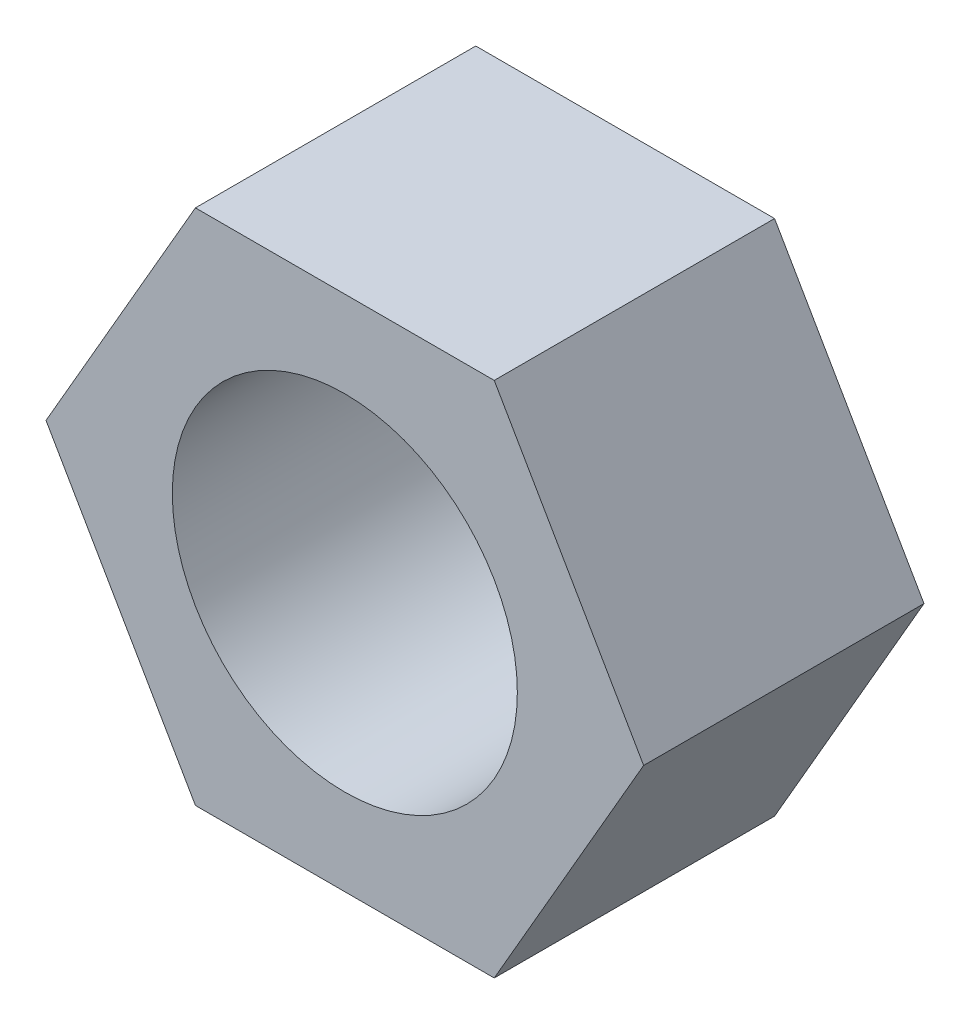
ISO-10303-21;
HEADER;
FILE_DESCRIPTION(('STEP AP214'),'2;1');
FILE_NAME('part.step','',(''),(''),'','','');
FILE_SCHEMA(('AUTOMOTIVE_DESIGN { 1 0 10303 214 1 1 1 1 }'));
ENDSEC;
DATA;
#1=APPLICATION_CONTEXT('core data for automotive mechanical design processes');
#2=APPLICATION_PROTOCOL_DEFINITION('international standard','automotive_design',2000,#1);
#3=PRODUCT_CONTEXT('',#1,'mechanical');
#4=PRODUCT('Part','Part','',(#3));
#5=PRODUCT_RELATED_PRODUCT_CATEGORY('part','',(#4));
#6=PRODUCT_DEFINITION_FORMATION('','',#4);
#7=PRODUCT_DEFINITION_CONTEXT('part definition',#1,'design');
#8=PRODUCT_DEFINITION('design','',#6,#7);
#9=PRODUCT_DEFINITION_SHAPE('','',#8);
#10=(LENGTH_UNIT() NAMED_UNIT(*) SI_UNIT(.MILLI.,.METRE.));
#11=(NAMED_UNIT(*) PLANE_ANGLE_UNIT() SI_UNIT($,.RADIAN.));
#12=(NAMED_UNIT(*) SI_UNIT($,.STERADIAN.) SOLID_ANGLE_UNIT());
#13=UNCERTAINTY_MEASURE_WITH_UNIT(LENGTH_MEASURE(1.E-05),#10,'distance_accuracy_value','');
#14=(GEOMETRIC_REPRESENTATION_CONTEXT(3) GLOBAL_UNCERTAINTY_ASSIGNED_CONTEXT((#13)) GLOBAL_UNIT_ASSIGNED_CONTEXT((#10,
#11,#12)) REPRESENTATION_CONTEXT('',''));
#15=CARTESIAN_POINT('',(0.,0.,0.));
#16=DIRECTION('',(0.,0.,1.));
#17=DIRECTION('',(1.,0.,0.));
#18=AXIS2_PLACEMENT_3D('',#15,#16,#17);
#19=CARTESIAN_POINT('',(0.,0.,6.5));
#20=DIRECTION('',(0.,0.,1.));
#21=DIRECTION('',(1.,0.,0.));
#22=AXIS2_PLACEMENT_3D('',#19,#20,#21);
#23=PLANE('',#22);
#24=DIRECTION('',(0.499999999999995,0.866025403784441,0.));
#25=VECTOR('',#24,1.);
#26=CARTESIAN_POINT('',(3.46410161513781,-5.99999999999994,6.5));
#27=LINE('',#26,#25);
#28=CARTESIAN_POINT('',(3.46410161513781,-5.99999999999994,6.5));
#29=VERTEX_POINT('',#28);
#30=CARTESIAN_POINT('',(6.92820323027549,0.,6.5));
#31=VERTEX_POINT('',#30);
#32=EDGE_CURVE('E129',#29,#31,#27,.T.);
#33=ORIENTED_EDGE('',*,*,#32,.T.);
#34=DIRECTION('',(-0.500000000000001,0.866025403784438,0.));
#35=VECTOR('',#34,1.);
#36=CARTESIAN_POINT('',(6.92820323027549,0.,6.5));
#37=LINE('',#36,#35);
#38=CARTESIAN_POINT('',(3.46410161513773,5.99999999999999,6.5));
#39=VERTEX_POINT('',#38);
#40=EDGE_CURVE('E87',#31,#39,#37,.T.);
#41=ORIENTED_EDGE('',*,*,#40,.T.);
#42=DIRECTION('',(-1.,0.,0.));
#43=VECTOR('',#42,1.);
#44=CARTESIAN_POINT('',(3.46410161513773,5.99999999999999,6.5));
#45=LINE('',#44,#43);
#46=CARTESIAN_POINT('',(-3.46410161513777,5.99999999999996,6.5));
#47=VERTEX_POINT('',#46);
#48=EDGE_CURVE('E100',#39,#47,#45,.T.);
#49=ORIENTED_EDGE('',*,*,#48,.T.);
#50=DIRECTION('',(-0.499999999999995,-0.866025403784442,0.));
#51=VECTOR('',#50,1.);
#52=CARTESIAN_POINT('',(-3.46410161513777,5.99999999999996,6.5));
#53=LINE('',#52,#51);
#54=CARTESIAN_POINT('',(-6.92820323027549,0.,6.5));
#55=VERTEX_POINT('',#54);
#56=EDGE_CURVE('E94',#47,#55,#53,.T.);
#57=ORIENTED_EDGE('',*,*,#56,.T.);
#58=DIRECTION('',(0.500000000000007,-0.866025403784434,0.));
#59=VECTOR('',#58,1.);
#60=CARTESIAN_POINT('',(-6.92820323027549,0.,6.5));
#61=LINE('',#60,#59);
#62=CARTESIAN_POINT('',(-3.46410161513769,-6.00000000000001,6.5));
#63=VERTEX_POINT('',#62);
#64=EDGE_CURVE('E98',#55,#63,#61,.T.);
#65=ORIENTED_EDGE('',*,*,#64,.T.);
#66=DIRECTION('',(1.,0.,0.));
#67=VECTOR('',#66,1.);
#68=CARTESIAN_POINT('',(-3.46410161513769,-6.00000000000001,6.5));
#69=LINE('',#68,#67);
#70=EDGE_CURVE('E50',#63,#29,#69,.T.);
#71=ORIENTED_EDGE('',*,*,#70,.T.);
#72=EDGE_LOOP('',(#33,#41,#49,#57,#65,#71));
#73=FACE_BOUND('',#72,.T.);
#74=CARTESIAN_POINT('',(0.,0.,6.5));
#75=DIRECTION('',(0.,0.,1.));
#76=DIRECTION('',(1.,0.,0.));
#77=AXIS2_PLACEMENT_3D('',#74,#75,#76);
#78=CIRCLE('',#77,4.);
#79=CARTESIAN_POINT('',(4.,0.,6.5));
#80=VERTEX_POINT('',#79);
#81=EDGE_CURVE('E122',#80,#80,#78,.T.);
#82=ORIENTED_EDGE('',*,*,#81,.F.);
#83=EDGE_LOOP('',(#82));
#84=FACE_BOUND('',#83,.T.);
#85=ADVANCED_FACE('F33',(#73,#84),#23,.T.);
#86=CARTESIAN_POINT('',(0.,0.,0.));
#87=DIRECTION('',(0.,0.,1.));
#88=DIRECTION('',(1.,0.,0.));
#89=AXIS2_PLACEMENT_3D('',#86,#87,#88);
#90=PLANE('',#89);
#91=DIRECTION('',(0.499999999999995,0.866025403784441,0.));
#92=VECTOR('',#91,1.);
#93=CARTESIAN_POINT('',(3.46410161513781,-5.99999999999994,0.));
#94=LINE('',#93,#92);
#95=CARTESIAN_POINT('',(3.46410161513781,-5.99999999999994,0.));
#96=VERTEX_POINT('',#95);
#97=CARTESIAN_POINT('',(6.92820323027549,0.,0.));
#98=VERTEX_POINT('',#97);
#99=EDGE_CURVE('E118',#96,#98,#94,.T.);
#100=ORIENTED_EDGE('',*,*,#99,.F.);
#101=DIRECTION('',(1.,0.,0.));
#102=VECTOR('',#101,1.);
#103=CARTESIAN_POINT('',(-3.46410161513769,-6.00000000000001,0.));
#104=LINE('',#103,#102);
#105=CARTESIAN_POINT('',(-3.46410161513769,-6.00000000000001,0.));
#106=VERTEX_POINT('',#105);
#107=EDGE_CURVE('E79',#106,#96,#104,.T.);
#108=ORIENTED_EDGE('',*,*,#107,.F.);
#109=DIRECTION('',(0.500000000000007,-0.866025403784434,0.));
#110=VECTOR('',#109,1.);
#111=CARTESIAN_POINT('',(-6.92820323027549,0.,0.));
#112=LINE('',#111,#110);
#113=CARTESIAN_POINT('',(-6.92820323027549,0.,0.));
#114=VERTEX_POINT('',#113);
#115=EDGE_CURVE('E73',#114,#106,#112,.T.);
#116=ORIENTED_EDGE('',*,*,#115,.F.);
#117=DIRECTION('',(-0.499999999999995,-0.866025403784442,0.));
#118=VECTOR('',#117,1.);
#119=CARTESIAN_POINT('',(-3.46410161513777,5.99999999999996,0.));
#120=LINE('',#119,#118);
#121=CARTESIAN_POINT('',(-3.46410161513777,5.99999999999996,0.));
#122=VERTEX_POINT('',#121);
#123=EDGE_CURVE('E108',#122,#114,#120,.T.);
#124=ORIENTED_EDGE('',*,*,#123,.F.);
#125=DIRECTION('',(-1.,0.,0.));
#126=VECTOR('',#125,1.);
#127=CARTESIAN_POINT('',(3.46410161513773,5.99999999999999,0.));
#128=LINE('',#127,#126);
#129=CARTESIAN_POINT('',(3.46410161513773,5.99999999999999,0.));
#130=VERTEX_POINT('',#129);
#131=EDGE_CURVE('E124',#130,#122,#128,.T.);
#132=ORIENTED_EDGE('',*,*,#131,.F.);
#133=DIRECTION('',(-0.500000000000001,0.866025403784438,0.));
#134=VECTOR('',#133,1.);
#135=CARTESIAN_POINT('',(6.92820323027549,0.,0.));
#136=LINE('',#135,#134);
#137=EDGE_CURVE('E121',#98,#130,#136,.T.);
#138=ORIENTED_EDGE('',*,*,#137,.F.);
#139=EDGE_LOOP('',(#100,#108,#116,#124,#132,#138));
#140=FACE_BOUND('',#139,.T.);
#141=CARTESIAN_POINT('',(0.,0.,0.));
#142=DIRECTION('',(0.,0.,1.));
#143=DIRECTION('',(1.,0.,0.));
#144=AXIS2_PLACEMENT_3D('',#141,#142,#143);
#145=CIRCLE('',#144,4.);
#146=CARTESIAN_POINT('',(4.,0.,0.));
#147=VERTEX_POINT('',#146);
#148=EDGE_CURVE('E222',#147,#147,#145,.T.);
#149=ORIENTED_EDGE('',*,*,#148,.T.);
#150=EDGE_LOOP('',(#149));
#151=FACE_BOUND('',#150,.T.);
#152=ADVANCED_FACE('F138',(#140,#151),#90,.F.);
#153=CARTESIAN_POINT('',(3.46410161513781,-5.99999999999994,6.5));
#154=DIRECTION('',(-0.866025403784441,0.499999999999995,0.));
#155=DIRECTION('',(-0.499999999999995,-0.866025403784442,0.));
#156=AXIS2_PLACEMENT_3D('',#153,#154,#155);
#157=PLANE('',#156);
#158=ORIENTED_EDGE('',*,*,#99,.T.);
#159=DIRECTION('',(0.,0.,-1.));
#160=VECTOR('',#159,1.);
#161=CARTESIAN_POINT('',(6.92820323027549,0.,6.5));
#162=LINE('',#161,#160);
#163=EDGE_CURVE('E11',#31,#98,#162,.T.);
#164=ORIENTED_EDGE('',*,*,#163,.F.);
#165=ORIENTED_EDGE('',*,*,#32,.F.);
#166=DIRECTION('',(0.,0.,-1.));
#167=VECTOR('',#166,1.);
#168=CARTESIAN_POINT('',(3.46410161513781,-5.99999999999994,6.5));
#169=LINE('',#168,#167);
#170=EDGE_CURVE('E114',#29,#96,#169,.T.);
#171=ORIENTED_EDGE('',*,*,#170,.T.);
#172=EDGE_LOOP('',(#158,#164,#165,#171));
#173=FACE_BOUND('',#172,.T.);
#174=ADVANCED_FACE('F35',(#173),#157,.F.);
#175=CARTESIAN_POINT('',(6.92820323027549,0.,6.5));
#176=DIRECTION('',(-0.866025403784438,-0.500000000000001,0.));
#177=DIRECTION('',(0.500000000000001,-0.866025403784438,0.));
#178=AXIS2_PLACEMENT_3D('',#175,#176,#177);
#179=PLANE('',#178);
#180=ORIENTED_EDGE('',*,*,#137,.T.);
#181=DIRECTION('',(0.,0.,-1.));
#182=VECTOR('',#181,1.);
#183=CARTESIAN_POINT('',(3.46410161513773,5.99999999999999,6.5));
#184=LINE('',#183,#182);
#185=EDGE_CURVE('E42',#39,#130,#184,.T.);
#186=ORIENTED_EDGE('',*,*,#185,.F.);
#187=ORIENTED_EDGE('',*,*,#40,.F.);
#188=ORIENTED_EDGE('',*,*,#163,.T.);
#189=EDGE_LOOP('',(#180,#186,#187,#188));
#190=FACE_BOUND('',#189,.T.);
#191=ADVANCED_FACE('F163',(#190),#179,.F.);
#192=CARTESIAN_POINT('',(3.46410161513773,5.99999999999999,6.5));
#193=DIRECTION('',(0.,-1.,0.));
#194=DIRECTION('',(1.,0.,0.));
#195=AXIS2_PLACEMENT_3D('',#192,#193,#194);
#196=PLANE('',#195);
#197=ORIENTED_EDGE('',*,*,#131,.T.);
#198=DIRECTION('',(0.,0.,-1.));
#199=VECTOR('',#198,1.);
#200=CARTESIAN_POINT('',(-3.46410161513777,5.99999999999996,6.5));
#201=LINE('',#200,#199);
#202=EDGE_CURVE('E109',#47,#122,#201,.T.);
#203=ORIENTED_EDGE('',*,*,#202,.F.);
#204=ORIENTED_EDGE('',*,*,#48,.F.);
#205=ORIENTED_EDGE('',*,*,#185,.T.);
#206=EDGE_LOOP('',(#197,#203,#204,#205));
#207=FACE_BOUND('',#206,.T.);
#208=ADVANCED_FACE('F135',(#207),#196,.F.);
#209=CARTESIAN_POINT('',(-3.46410161513777,5.99999999999996,6.5));
#210=DIRECTION('',(0.866025403784442,-0.499999999999995,0.));
#211=DIRECTION('',(0.499999999999995,0.866025403784442,0.));
#212=AXIS2_PLACEMENT_3D('',#209,#210,#211);
#213=PLANE('',#212);
#214=ORIENTED_EDGE('',*,*,#123,.T.);
#215=DIRECTION('',(0.,0.,-1.));
#216=VECTOR('',#215,1.);
#217=CARTESIAN_POINT('',(-6.92820323027549,0.,6.5));
#218=LINE('',#217,#216);
#219=EDGE_CURVE('E105',#55,#114,#218,.T.);
#220=ORIENTED_EDGE('',*,*,#219,.F.);
#221=ORIENTED_EDGE('',*,*,#56,.F.);
#222=ORIENTED_EDGE('',*,*,#202,.T.);
#223=EDGE_LOOP('',(#214,#220,#221,#222));
#224=FACE_BOUND('',#223,.T.);
#225=ADVANCED_FACE('F106',(#224),#213,.F.);
#226=CARTESIAN_POINT('',(-6.92820323027549,0.,6.5));
#227=DIRECTION('',(0.866025403784434,0.500000000000007,0.));
#228=DIRECTION('',(-0.500000000000007,0.866025403784435,0.));
#229=AXIS2_PLACEMENT_3D('',#226,#227,#228);
#230=PLANE('',#229);
#231=ORIENTED_EDGE('',*,*,#115,.T.);
#232=DIRECTION('',(0.,0.,-1.));
#233=VECTOR('',#232,1.);
#234=CARTESIAN_POINT('',(-3.46410161513769,-6.00000000000001,6.5));
#235=LINE('',#234,#233);
#236=EDGE_CURVE('E110',#63,#106,#235,.T.);
#237=ORIENTED_EDGE('',*,*,#236,.F.);
#238=ORIENTED_EDGE('',*,*,#64,.F.);
#239=ORIENTED_EDGE('',*,*,#219,.T.);
#240=EDGE_LOOP('',(#231,#237,#238,#239));
#241=FACE_BOUND('',#240,.T.);
#242=ADVANCED_FACE('F112',(#241),#230,.F.);
#243=CARTESIAN_POINT('',(-3.46410161513769,-6.00000000000001,6.5));
#244=DIRECTION('',(0.,1.,0.));
#245=DIRECTION('',(-1.,0.,0.));
#246=AXIS2_PLACEMENT_3D('',#243,#244,#245);
#247=PLANE('',#246);
#248=ORIENTED_EDGE('',*,*,#107,.T.);
#249=ORIENTED_EDGE('',*,*,#170,.F.);
#250=ORIENTED_EDGE('',*,*,#70,.F.);
#251=ORIENTED_EDGE('',*,*,#236,.T.);
#252=EDGE_LOOP('',(#248,#249,#250,#251));
#253=FACE_BOUND('',#252,.T.);
#254=ADVANCED_FACE('F143',(#253),#247,.F.);
#255=CARTESIAN_POINT('',(0.,0.,6.5));
#256=DIRECTION('',(0.,0.,-1.));
#257=DIRECTION('',(-1.,0.,0.));
#258=AXIS2_PLACEMENT_3D('',#255,#256,#257);
#259=CYLINDRICAL_SURFACE('',#258,4.);
#260=ORIENTED_EDGE('',*,*,#81,.T.);
#261=EDGE_LOOP('',(#260));
#262=FACE_BOUND('',#261,.T.);
#263=ORIENTED_EDGE('',*,*,#148,.F.);
#264=EDGE_LOOP('',(#263));
#265=FACE_BOUND('',#264,.T.);
#266=ADVANCED_FACE('F145',(#262,#265),#259,.F.);
#267=CLOSED_SHELL('',(#85,#152,#174,#191,#208,#225,#242,#254,#266));
#268=MANIFOLD_SOLID_BREP('B2',#267);
#269=ADVANCED_BREP_SHAPE_REPRESENTATION('',(#18,#268),#14);
#270=SHAPE_DEFINITION_REPRESENTATION(#9,#269);
ENDSEC;
END-ISO-10303-21;
